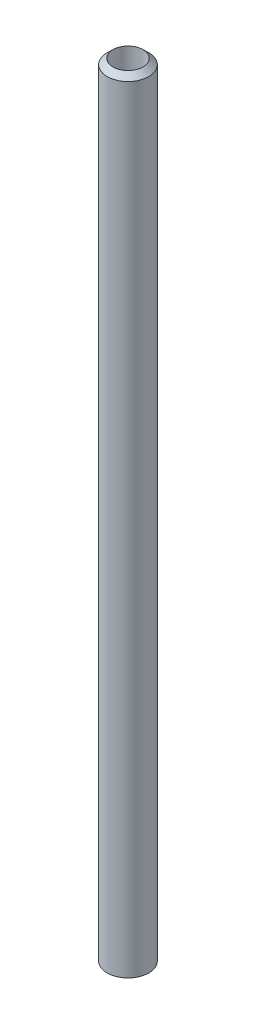
ISO-10303-21;
HEADER;
FILE_DESCRIPTION(('STEP AP214'),'2;1');
FILE_NAME('part.step','',(''),(''),'','','');
FILE_SCHEMA(('AUTOMOTIVE_DESIGN { 1 0 10303 214 1 1 1 1 }'));
ENDSEC;
DATA;
#1=APPLICATION_CONTEXT('core data for automotive mechanical design processes');
#2=APPLICATION_PROTOCOL_DEFINITION('international standard','automotive_design',2000,#1);
#3=PRODUCT_CONTEXT('',#1,'mechanical');
#4=PRODUCT('Part','Part','',(#3));
#5=PRODUCT_RELATED_PRODUCT_CATEGORY('part','',(#4));
#6=PRODUCT_DEFINITION_FORMATION('','',#4);
#7=PRODUCT_DEFINITION_CONTEXT('part definition',#1,'design');
#8=PRODUCT_DEFINITION('design','',#6,#7);
#9=PRODUCT_DEFINITION_SHAPE('','',#8);
#10=(LENGTH_UNIT() NAMED_UNIT(*) SI_UNIT(.MILLI.,.METRE.));
#11=(NAMED_UNIT(*) PLANE_ANGLE_UNIT() SI_UNIT($,.RADIAN.));
#12=(NAMED_UNIT(*) SI_UNIT($,.STERADIAN.) SOLID_ANGLE_UNIT());
#13=UNCERTAINTY_MEASURE_WITH_UNIT(LENGTH_MEASURE(1.E-05),#10,'distance_accuracy_value','');
#14=(GEOMETRIC_REPRESENTATION_CONTEXT(3) GLOBAL_UNCERTAINTY_ASSIGNED_CONTEXT((#13)) GLOBAL_UNIT_ASSIGNED_CONTEXT((#10,
#11,#12)) REPRESENTATION_CONTEXT('',''));
#15=CARTESIAN_POINT('',(0.,0.,0.));
#16=DIRECTION('',(0.,0.,1.));
#17=DIRECTION('',(1.,0.,0.));
#18=AXIS2_PLACEMENT_3D('',#15,#16,#17);
#19=CARTESIAN_POINT('',(0.,180.34,0.));
#20=DIRECTION('',(0.,-1.,0.));
#21=DIRECTION('',(0.,0.,-1.));
#22=AXIS2_PLACEMENT_3D('',#19,#20,#21);
#23=CYLINDRICAL_SURFACE('',#22,4.826);
#24=CARTESIAN_POINT('',(0.,180.34,0.));
#25=DIRECTION('',(0.,1.,0.));
#26=DIRECTION('',(0.,0.,1.));
#27=AXIS2_PLACEMENT_3D('',#24,#25,#26);
#28=CIRCLE('',#27,4.826);
#29=CARTESIAN_POINT('',(0.,180.34,4.826));
#30=VERTEX_POINT('',#29);
#31=EDGE_CURVE('E11',#30,#30,#28,.T.);
#32=ORIENTED_EDGE('',*,*,#31,.F.);
#33=EDGE_LOOP('',(#32));
#34=FACE_BOUND('',#33,.T.);
#35=CARTESIAN_POINT('',(0.,0.,0.));
#36=DIRECTION('',(0.,1.,0.));
#37=DIRECTION('',(0.,0.,1.));
#38=AXIS2_PLACEMENT_3D('',#35,#36,#37);
#39=CIRCLE('',#38,4.826);
#40=CARTESIAN_POINT('',(0.,0.,4.826));
#41=VERTEX_POINT('',#40);
#42=EDGE_CURVE('E37',#41,#41,#39,.T.);
#43=ORIENTED_EDGE('',*,*,#42,.T.);
#44=EDGE_LOOP('',(#43));
#45=FACE_BOUND('',#44,.T.);
#46=ADVANCED_FACE('F34',(#34,#45),#23,.T.);
#47=CARTESIAN_POINT('',(0.,0.,0.));
#48=DIRECTION('',(0.,1.,0.));
#49=DIRECTION('',(0.,0.,1.));
#50=AXIS2_PLACEMENT_3D('',#47,#48,#49);
#51=PLANE('',#50);
#52=CARTESIAN_POINT('',(0.,0.,0.));
#53=DIRECTION('',(0.,1.,0.));
#54=DIRECTION('',(0.,0.,1.));
#55=AXIS2_PLACEMENT_3D('',#52,#53,#54);
#56=CIRCLE('',#55,3.49123);
#57=CARTESIAN_POINT('',(0.,0.,3.49123));
#58=VERTEX_POINT('',#57);
#59=EDGE_CURVE('E48',#58,#58,#56,.T.);
#60=ORIENTED_EDGE('',*,*,#59,.T.);
#61=EDGE_LOOP('',(#60));
#62=FACE_BOUND('',#61,.T.);
#63=ORIENTED_EDGE('',*,*,#42,.F.);
#64=EDGE_LOOP('',(#63));
#65=FACE_BOUND('',#64,.T.);
#66=ADVANCED_FACE('F66',(#62,#65),#51,.F.);
#67=CARTESIAN_POINT('',(0.,181.61,0.));
#68=DIRECTION('',(0.,-1.,0.));
#69=DIRECTION('',(0.,0.,-1.));
#70=AXIS2_PLACEMENT_3D('',#67,#68,#69);
#71=CONICAL_SURFACE('',#70,3.4925,0.809783572570169);
#72=CARTESIAN_POINT('',(0.,181.61,0.));
#73=DIRECTION('',(0.,1.,0.));
#74=DIRECTION('',(0.,0.,1.));
#75=AXIS2_PLACEMENT_3D('',#72,#73,#74);
#76=CIRCLE('',#75,3.4925);
#77=CARTESIAN_POINT('',(0.,181.61,3.4925));
#78=VERTEX_POINT('',#77);
#79=EDGE_CURVE('E44',#78,#78,#76,.T.);
#80=ORIENTED_EDGE('',*,*,#79,.F.);
#81=EDGE_LOOP('',(#80));
#82=FACE_BOUND('',#81,.T.);
#83=ORIENTED_EDGE('',*,*,#31,.T.);
#84=EDGE_LOOP('',(#83));
#85=FACE_BOUND('',#84,.T.);
#86=ADVANCED_FACE('F61',(#82,#85),#71,.T.);
#87=CARTESIAN_POINT('',(0.,181.61,0.));
#88=DIRECTION('',(0.,1.,0.));
#89=DIRECTION('',(0.,0.,1.));
#90=AXIS2_PLACEMENT_3D('',#87,#88,#89);
#91=PLANE('',#90);
#92=CARTESIAN_POINT('',(0.,181.61,0.));
#93=DIRECTION('',(0.,1.,0.));
#94=DIRECTION('',(0.,0.,1.));
#95=AXIS2_PLACEMENT_3D('',#92,#93,#94);
#96=CIRCLE('',#95,3.49123);
#97=CARTESIAN_POINT('',(0.,181.61,3.49123));
#98=VERTEX_POINT('',#97);
#99=EDGE_CURVE('E51',#98,#98,#96,.T.);
#100=ORIENTED_EDGE('',*,*,#99,.F.);
#101=EDGE_LOOP('',(#100));
#102=FACE_BOUND('',#101,.T.);
#103=ORIENTED_EDGE('',*,*,#79,.T.);
#104=EDGE_LOOP('',(#103));
#105=FACE_BOUND('',#104,.T.);
#106=ADVANCED_FACE('F58',(#102,#105),#91,.T.);
#107=CARTESIAN_POINT('',(0.,-21.59,0.));
#108=DIRECTION('',(0.,1.,0.));
#109=DIRECTION('',(0.,0.,1.));
#110=AXIS2_PLACEMENT_3D('',#107,#108,#109);
#111=CYLINDRICAL_SURFACE('',#110,3.49123);
#112=ORIENTED_EDGE('',*,*,#99,.T.);
#113=EDGE_LOOP('',(#112));
#114=FACE_BOUND('',#113,.T.);
#115=ORIENTED_EDGE('',*,*,#59,.F.);
#116=EDGE_LOOP('',(#115));
#117=FACE_BOUND('',#116,.T.);
#118=ADVANCED_FACE('F55',(#114,#117),#111,.F.);
#119=CLOSED_SHELL('',(#46,#66,#86,#106,#118));
#120=MANIFOLD_SOLID_BREP('B2',#119);
#121=ADVANCED_BREP_SHAPE_REPRESENTATION('',(#18,#120),#14);
#122=SHAPE_DEFINITION_REPRESENTATION(#9,#121);
ENDSEC;
END-ISO-10303-21;
